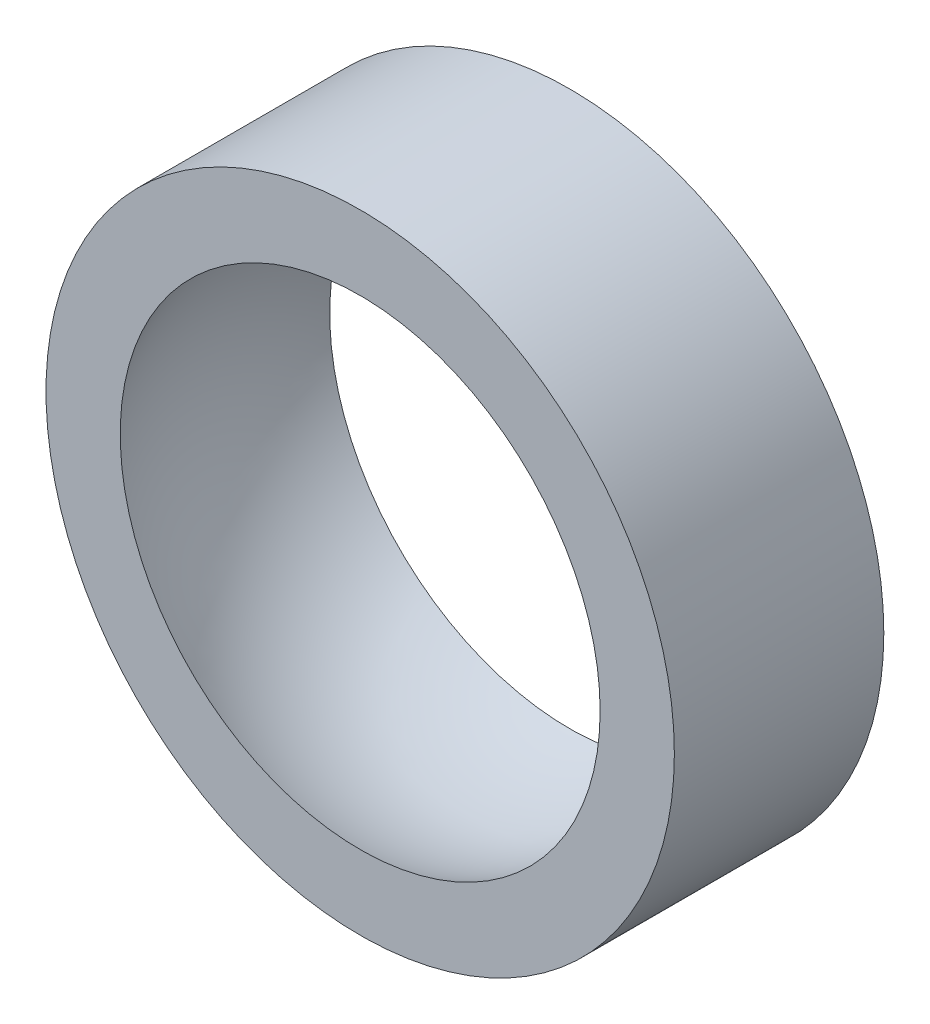
ISO-10303-21;
HEADER;
FILE_DESCRIPTION(('STEP AP214'),'2;1');
FILE_NAME('part.step','',(''),(''),'','','');
FILE_SCHEMA(('AUTOMOTIVE_DESIGN { 1 0 10303 214 1 1 1 1 }'));
ENDSEC;
DATA;
#1=APPLICATION_CONTEXT('core data for automotive mechanical design processes');
#2=APPLICATION_PROTOCOL_DEFINITION('international standard','automotive_design',2000,#1);
#3=PRODUCT_CONTEXT('',#1,'mechanical');
#4=PRODUCT('Part','Part','',(#3));
#5=PRODUCT_RELATED_PRODUCT_CATEGORY('part','',(#4));
#6=PRODUCT_DEFINITION_FORMATION('','',#4);
#7=PRODUCT_DEFINITION_CONTEXT('part definition',#1,'design');
#8=PRODUCT_DEFINITION('design','',#6,#7);
#9=PRODUCT_DEFINITION_SHAPE('','',#8);
#10=(LENGTH_UNIT() NAMED_UNIT(*) SI_UNIT(.MILLI.,.METRE.));
#11=(NAMED_UNIT(*) PLANE_ANGLE_UNIT() SI_UNIT($,.RADIAN.));
#12=(NAMED_UNIT(*) SI_UNIT($,.STERADIAN.) SOLID_ANGLE_UNIT());
#13=UNCERTAINTY_MEASURE_WITH_UNIT(LENGTH_MEASURE(1.E-05),#10,'distance_accuracy_value','');
#14=(GEOMETRIC_REPRESENTATION_CONTEXT(3) GLOBAL_UNCERTAINTY_ASSIGNED_CONTEXT((#13)) GLOBAL_UNIT_ASSIGNED_CONTEXT((#10,
#11,#12)) REPRESENTATION_CONTEXT('',''));
#15=CARTESIAN_POINT('',(0.,0.,0.));
#16=DIRECTION('',(0.,0.,1.));
#17=DIRECTION('',(1.,0.,0.));
#18=AXIS2_PLACEMENT_3D('',#15,#16,#17);
#19=CARTESIAN_POINT('',(0.,0.,5.));
#20=DIRECTION('',(0.,0.,1.));
#21=DIRECTION('',(1.,0.,0.));
#22=AXIS2_PLACEMENT_3D('',#19,#20,#21);
#23=PLANE('',#22);
#24=CARTESIAN_POINT('',(0.,0.,5.));
#25=DIRECTION('',(0.,0.,1.));
#26=DIRECTION('',(1.,0.,0.));
#27=AXIS2_PLACEMENT_3D('',#24,#25,#26);
#28=CIRCLE('',#27,15.);
#29=CARTESIAN_POINT('',(15.,0.,4.99999999999998));
#30=VERTEX_POINT('',#29);
#31=EDGE_CURVE('E10',#30,#30,#28,.T.);
#32=ORIENTED_EDGE('',*,*,#31,.T.);
#33=EDGE_LOOP('',(#32));
#34=FACE_BOUND('',#33,.T.);
#35=CARTESIAN_POINT('',(0.,0.,5.));
#36=DIRECTION('',(0.,0.,1.));
#37=DIRECTION('',(1.,0.,0.));
#38=AXIS2_PLACEMENT_3D('',#35,#36,#37);
#39=CIRCLE('',#38,11.4564392373896);
#40=CARTESIAN_POINT('',(11.4564392373896,0.,4.99999999999999));
#41=VERTEX_POINT('',#40);
#42=EDGE_CURVE('E49',#41,#41,#39,.F.);
#43=ORIENTED_EDGE('',*,*,#42,.T.);
#44=EDGE_LOOP('',(#43));
#45=FACE_BOUND('',#44,.T.);
#46=ADVANCED_FACE('F34',(#34,#45),#23,.T.);
#47=CARTESIAN_POINT('',(0.,0.,-5.));
#48=DIRECTION('',(0.,0.,1.));
#49=DIRECTION('',(1.,0.,0.));
#50=AXIS2_PLACEMENT_3D('',#47,#48,#49);
#51=PLANE('',#50);
#52=CARTESIAN_POINT('',(0.,0.,-5.));
#53=DIRECTION('',(0.,0.,1.));
#54=DIRECTION('',(1.,0.,0.));
#55=AXIS2_PLACEMENT_3D('',#52,#53,#54);
#56=CIRCLE('',#55,15.);
#57=CARTESIAN_POINT('',(15.,0.,-5.00000000000002));
#58=VERTEX_POINT('',#57);
#59=EDGE_CURVE('E43',#58,#58,#56,.T.);
#60=ORIENTED_EDGE('',*,*,#59,.F.);
#61=EDGE_LOOP('',(#60));
#62=FACE_BOUND('',#61,.T.);
#63=CARTESIAN_POINT('',(0.,0.,-5.));
#64=DIRECTION('',(0.,0.,1.));
#65=DIRECTION('',(1.,0.,0.));
#66=AXIS2_PLACEMENT_3D('',#63,#64,#65);
#67=CIRCLE('',#66,11.4564392373896);
#68=CARTESIAN_POINT('',(11.4564392373896,0.,-5.00000000000002));
#69=VERTEX_POINT('',#68);
#70=EDGE_CURVE('E38',#69,#69,#67,.F.);
#71=ORIENTED_EDGE('',*,*,#70,.F.);
#72=EDGE_LOOP('',(#71));
#73=FACE_BOUND('',#72,.T.);
#74=ADVANCED_FACE('F64',(#62,#73),#51,.F.);
#75=CARTESIAN_POINT('',(0.,0.,5.));
#76=DIRECTION('',(0.,0.,-1.));
#77=DIRECTION('',(-1.,0.,0.));
#78=AXIS2_PLACEMENT_3D('',#75,#76,#77);
#79=CYLINDRICAL_SURFACE('',#78,15.);
#80=ORIENTED_EDGE('',*,*,#31,.F.);
#81=EDGE_LOOP('',(#80));
#82=FACE_BOUND('',#81,.T.);
#83=ORIENTED_EDGE('',*,*,#59,.T.);
#84=EDGE_LOOP('',(#83));
#85=FACE_BOUND('',#84,.T.);
#86=ADVANCED_FACE('F36',(#82,#85),#79,.T.);
#87=CARTESIAN_POINT('',(0.,0.,0.));
#88=DIRECTION('',(0.,1.,0.));
#89=DIRECTION('',(1.,0.,0.));
#90=AXIS2_PLACEMENT_3D('',#87,#88,#89);
#91=SPHERICAL_SURFACE('',#90,12.5);
#92=CARTESIAN_POINT('',(0.,0.,0.));
#93=DIRECTION('',(0.,0.,1.));
#94=DIRECTION('',(1.,0.,0.));
#95=AXIS2_PLACEMENT_3D('',#92,#93,#94);
#96=SPHERICAL_SURFACE('',#95,12.5);
#97=ORIENTED_EDGE('',*,*,#42,.F.);
#98=EDGE_LOOP('',(#97));
#99=FACE_BOUND('',#98,.T.);
#100=ORIENTED_EDGE('',*,*,#70,.T.);
#101=EDGE_LOOP('',(#100));
#102=FACE_BOUND('',#101,.T.);
#103=ADVANCED_FACE('F62',(#99,#102),#96,.F.);
#104=CLOSED_SHELL('',(#46,#74,#86,#103));
#105=MANIFOLD_SOLID_BREP('B2',#104);
#106=ADVANCED_BREP_SHAPE_REPRESENTATION('',(#18,#105),#14);
#107=SHAPE_DEFINITION_REPRESENTATION(#9,#106);
ENDSEC;
END-ISO-10303-21;
